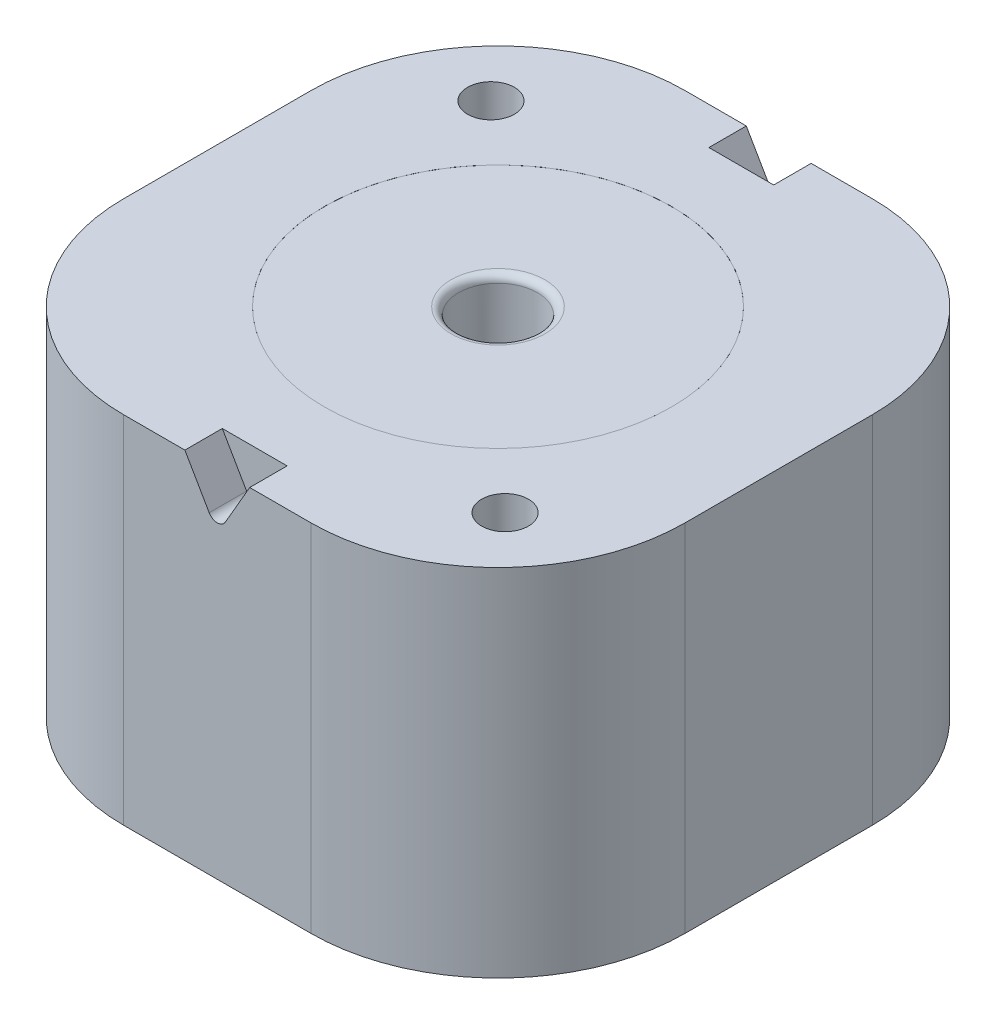
ISO-10303-21;
HEADER;
FILE_DESCRIPTION(('STEP AP214'),'2;1');
FILE_NAME('part.step','',(''),(''),'','','');
FILE_SCHEMA(('AUTOMOTIVE_DESIGN { 1 0 10303 214 1 1 1 1 }'));
ENDSEC;
DATA;
#1=APPLICATION_CONTEXT('core data for automotive mechanical design processes');
#2=APPLICATION_PROTOCOL_DEFINITION('international standard','automotive_design',2000,#1);
#3=PRODUCT_CONTEXT('',#1,'mechanical');
#4=PRODUCT('Part','Part','',(#3));
#5=PRODUCT_RELATED_PRODUCT_CATEGORY('part','',(#4));
#6=PRODUCT_DEFINITION_FORMATION('','',#4);
#7=PRODUCT_DEFINITION_CONTEXT('part definition',#1,'design');
#8=PRODUCT_DEFINITION('design','',#6,#7);
#9=PRODUCT_DEFINITION_SHAPE('','',#8);
#10=(LENGTH_UNIT() NAMED_UNIT(*) SI_UNIT(.MILLI.,.METRE.));
#11=(NAMED_UNIT(*) PLANE_ANGLE_UNIT() SI_UNIT($,.RADIAN.));
#12=(NAMED_UNIT(*) SI_UNIT($,.STERADIAN.) SOLID_ANGLE_UNIT());
#13=UNCERTAINTY_MEASURE_WITH_UNIT(LENGTH_MEASURE(1.E-05),#10,'distance_accuracy_value','');
#14=(GEOMETRIC_REPRESENTATION_CONTEXT(3) GLOBAL_UNCERTAINTY_ASSIGNED_CONTEXT((#13)) GLOBAL_UNIT_ASSIGNED_CONTEXT((#10,
#11,#12)) REPRESENTATION_CONTEXT('',''));
#15=CARTESIAN_POINT('',(0.,0.,0.));
#16=DIRECTION('',(0.,0.,1.));
#17=DIRECTION('',(1.,0.,0.));
#18=AXIS2_PLACEMENT_3D('',#15,#16,#17);
#19=CARTESIAN_POINT('',(-15.,19.,-15.01));
#20=DIRECTION('',(0.,-1.,0.));
#21=DIRECTION('',(0.,0.,-1.));
#22=AXIS2_PLACEMENT_3D('',#19,#20,#21);
#23=PLANE('',#22);
#24=CARTESIAN_POINT('',(9.71815906597584,19.,9.34105517720241));
#25=DIRECTION('',(0.,-1.,0.));
#26=DIRECTION('',(0.,0.,-1.));
#27=AXIS2_PLACEMENT_3D('',#24,#25,#26);
#28=CIRCLE('',#27,1.25);
#29=CARTESIAN_POINT('',(9.71815906597584,19.,8.09105517720241));
#30=VERTEX_POINT('',#29);
#31=EDGE_CURVE('E188',#30,#30,#28,.T.);
#32=ORIENTED_EDGE('',*,*,#31,.T.);
#33=EDGE_LOOP('',(#32));
#34=FACE_BOUND('',#33,.T.);
#35=CARTESIAN_POINT('',(-9.71815906597584,19.,-9.34105517720241));
#36=DIRECTION('',(0.,-1.,0.));
#37=DIRECTION('',(0.,0.,-1.));
#38=AXIS2_PLACEMENT_3D('',#35,#36,#37);
#39=CIRCLE('',#38,1.25);
#40=CARTESIAN_POINT('',(-9.71815906597584,19.,-10.5910551772024));
#41=VERTEX_POINT('',#40);
#42=EDGE_CURVE('E191',#41,#41,#39,.T.);
#43=ORIENTED_EDGE('',*,*,#42,.T.);
#44=EDGE_LOOP('',(#43));
#45=FACE_BOUND('',#44,.T.);
#46=CARTESIAN_POINT('',(0.,19.,0.));
#47=DIRECTION('',(0.,-1.,0.));
#48=DIRECTION('',(0.,0.,-1.));
#49=AXIS2_PLACEMENT_3D('',#46,#47,#48);
#50=CIRCLE('',#49,9.27774999999996);
#51=CARTESIAN_POINT('',(0.,19.,-9.27774999999995));
#52=VERTEX_POINT('',#51);
#53=EDGE_CURVE('E255',#52,#52,#50,.F.);
#54=ORIENTED_EDGE('',*,*,#53,.F.);
#55=EDGE_LOOP('',(#54));
#56=FACE_BOUND('',#55,.T.);
#57=DIRECTION('',(0.,0.,1.));
#58=VECTOR('',#57,1.);
#59=CARTESIAN_POINT('',(-1.73205080756887,19.,-15.01));
#60=LINE('',#59,#58);
#61=CARTESIAN_POINT('',(-1.73205080756888,19.,-15.));
#62=VERTEX_POINT('',#61);
#63=CARTESIAN_POINT('',(-1.73205080756887,19.,-13.));
#64=VERTEX_POINT('',#63);
#65=EDGE_CURVE('E170',#62,#64,#60,.T.);
#66=ORIENTED_EDGE('',*,*,#65,.F.);
#67=DIRECTION('',(1.,0.,0.));
#68=VECTOR('',#67,1.);
#69=CARTESIAN_POINT('',(15.,19.,-15.));
#70=LINE('',#69,#68);
#71=CARTESIAN_POINT('',(-5.,19.,-15.));
#72=VERTEX_POINT('',#71);
#73=EDGE_CURVE('E259',#72,#62,#70,.T.);
#74=ORIENTED_EDGE('',*,*,#73,.F.);
#75=CARTESIAN_POINT('',(-5.,19.,-4.99999999999999));
#76=DIRECTION('',(0.,-1.,0.));
#77=DIRECTION('',(0.,0.,-1.));
#78=AXIS2_PLACEMENT_3D('',#75,#76,#77);
#79=CIRCLE('',#78,10.);
#80=CARTESIAN_POINT('',(-15.,19.,-4.99999999999999));
#81=VERTEX_POINT('',#80);
#82=EDGE_CURVE('E265',#72,#81,#79,.F.);
#83=ORIENTED_EDGE('',*,*,#82,.T.);
#84=DIRECTION('',(0.,0.,-1.));
#85=VECTOR('',#84,1.);
#86=CARTESIAN_POINT('',(-15.,19.,-15.));
#87=LINE('',#86,#85);
#88=CARTESIAN_POINT('',(-15.,19.,5.00000000000001));
#89=VERTEX_POINT('',#88);
#90=EDGE_CURVE('E263',#89,#81,#87,.T.);
#91=ORIENTED_EDGE('',*,*,#90,.F.);
#92=CARTESIAN_POINT('',(-5.,19.,5.00000000000001));
#93=DIRECTION('',(0.,-1.,0.));
#94=DIRECTION('',(0.,0.,-1.));
#95=AXIS2_PLACEMENT_3D('',#92,#93,#94);
#96=CIRCLE('',#95,10.);
#97=CARTESIAN_POINT('',(-5.,19.,15.));
#98=VERTEX_POINT('',#97);
#99=EDGE_CURVE('E270',#89,#98,#96,.F.);
#100=ORIENTED_EDGE('',*,*,#99,.T.);
#101=DIRECTION('',(-1.,0.,0.));
#102=VECTOR('',#101,1.);
#103=CARTESIAN_POINT('',(15.,19.,15.));
#104=LINE('',#103,#102);
#105=CARTESIAN_POINT('',(-1.73205080756887,19.,15.));
#106=VERTEX_POINT('',#105);
#107=EDGE_CURVE('E258',#106,#98,#104,.T.);
#108=ORIENTED_EDGE('',*,*,#107,.F.);
#109=DIRECTION('',(0.,0.,-1.));
#110=VECTOR('',#109,1.);
#111=CARTESIAN_POINT('',(-1.73205080756887,19.,-15.01));
#112=LINE('',#111,#110);
#113=CARTESIAN_POINT('',(-1.73205080756887,19.,13.));
#114=VERTEX_POINT('',#113);
#115=EDGE_CURVE('E185',#106,#114,#112,.T.);
#116=ORIENTED_EDGE('',*,*,#115,.T.);
#117=DIRECTION('',(-1.,0.,0.));
#118=VECTOR('',#117,1.);
#119=CARTESIAN_POINT('',(-15.,19.,13.));
#120=LINE('',#119,#118);
#121=CARTESIAN_POINT('',(1.73205080756888,19.,13.));
#122=VERTEX_POINT('',#121);
#123=EDGE_CURVE('E288',#122,#114,#120,.T.);
#124=ORIENTED_EDGE('',*,*,#123,.F.);
#125=DIRECTION('',(0.,0.,1.));
#126=VECTOR('',#125,1.);
#127=CARTESIAN_POINT('',(1.73205080756888,19.,-15.01));
#128=LINE('',#127,#126);
#129=CARTESIAN_POINT('',(1.73205080756888,19.,15.));
#130=VERTEX_POINT('',#129);
#131=EDGE_CURVE('E181',#122,#130,#128,.T.);
#132=ORIENTED_EDGE('',*,*,#131,.T.);
#133=CARTESIAN_POINT('',(5.,19.,15.));
#134=VERTEX_POINT('',#133);
#135=EDGE_CURVE('E260',#134,#130,#104,.T.);
#136=ORIENTED_EDGE('',*,*,#135,.F.);
#137=CARTESIAN_POINT('',(5.,19.,5.00000000000001));
#138=DIRECTION('',(0.,-1.,0.));
#139=DIRECTION('',(0.,0.,-1.));
#140=AXIS2_PLACEMENT_3D('',#137,#138,#139);
#141=CIRCLE('',#140,10.);
#142=CARTESIAN_POINT('',(15.,19.,5.));
#143=VERTEX_POINT('',#142);
#144=EDGE_CURVE('E266',#134,#143,#141,.F.);
#145=ORIENTED_EDGE('',*,*,#144,.T.);
#146=DIRECTION('',(0.,0.,1.));
#147=VECTOR('',#146,1.);
#148=CARTESIAN_POINT('',(15.,19.,-15.));
#149=LINE('',#148,#147);
#150=CARTESIAN_POINT('',(15.,19.,-4.99999999999999));
#151=VERTEX_POINT('',#150);
#152=EDGE_CURVE('E256',#151,#143,#149,.T.);
#153=ORIENTED_EDGE('',*,*,#152,.F.);
#154=CARTESIAN_POINT('',(5.,19.,-4.99999999999999));
#155=DIRECTION('',(0.,-1.,0.));
#156=DIRECTION('',(0.,0.,-1.));
#157=AXIS2_PLACEMENT_3D('',#154,#155,#156);
#158=CIRCLE('',#157,10.);
#159=CARTESIAN_POINT('',(4.99999999999999,19.,-15.));
#160=VERTEX_POINT('',#159);
#161=EDGE_CURVE('E273',#151,#160,#158,.F.);
#162=ORIENTED_EDGE('',*,*,#161,.T.);
#163=CARTESIAN_POINT('',(1.73205080756888,19.,-15.));
#164=VERTEX_POINT('',#163);
#165=EDGE_CURVE('E169',#164,#160,#70,.T.);
#166=ORIENTED_EDGE('',*,*,#165,.F.);
#167=DIRECTION('',(0.,0.,-1.));
#168=VECTOR('',#167,1.);
#169=CARTESIAN_POINT('',(1.73205080756888,19.,-15.01));
#170=LINE('',#169,#168);
#171=CARTESIAN_POINT('',(1.73205080756888,19.,-13.));
#172=VERTEX_POINT('',#171);
#173=EDGE_CURVE('E150',#172,#164,#170,.T.);
#174=ORIENTED_EDGE('',*,*,#173,.F.);
#175=DIRECTION('',(1.,0.,0.));
#176=VECTOR('',#175,1.);
#177=CARTESIAN_POINT('',(-15.,19.,-13.));
#178=LINE('',#177,#176);
#179=EDGE_CURVE('E160',#64,#172,#178,.T.);
#180=ORIENTED_EDGE('',*,*,#179,.F.);
#181=EDGE_LOOP('',(#66,#74,#83,#91,#100,#108,#116,#124,#132,#136,#145,#153,#162,#166,#174,#180));
#182=FACE_BOUND('',#181,.T.);
#183=ADVANCED_FACE('F33',(#34,#45,#56,#182),#23,.F.);
#184=CARTESIAN_POINT('',(15.,20.,-15.));
#185=DIRECTION('',(0.,0.,1.));
#186=DIRECTION('',(1.,0.,0.));
#187=AXIS2_PLACEMENT_3D('',#184,#185,#186);
#188=PLANE('',#187);
#189=DIRECTION('',(-0.5,0.866025403784438,0.));
#190=VECTOR('',#189,1.);
#191=CARTESIAN_POINT('',(2.01794919243113,12.5048094716167,-15.));
#192=LINE('',#191,#190);
#193=CARTESIAN_POINT('',(-0.433012701892218,16.75,-15.));
#194=VERTEX_POINT('',#193);
#195=EDGE_CURVE('E166',#194,#62,#192,.T.);
#196=ORIENTED_EDGE('',*,*,#195,.F.);
#197=CARTESIAN_POINT('',(0.,17.,-15.));
#198=DIRECTION('',(0.,0.,1.));
#199=DIRECTION('',(1.,0.,0.));
#200=AXIS2_PLACEMENT_3D('',#197,#198,#199);
#201=CIRCLE('',#200,0.5);
#202=CARTESIAN_POINT('',(0.433012701892225,16.75,-15.));
#203=VERTEX_POINT('',#202);
#204=EDGE_CURVE('E41',#194,#203,#201,.T.);
#205=ORIENTED_EDGE('',*,*,#204,.T.);
#206=DIRECTION('',(0.5,0.866025403784439,0.));
#207=VECTOR('',#206,1.);
#208=CARTESIAN_POINT('',(0.,16.,-15.));
#209=LINE('',#208,#207);
#210=EDGE_CURVE('E175',#203,#164,#209,.T.);
#211=ORIENTED_EDGE('',*,*,#210,.T.);
#212=ORIENTED_EDGE('',*,*,#165,.T.);
#213=DIRECTION('',(0.,-1.,0.));
#214=VECTOR('',#213,1.);
#215=CARTESIAN_POINT('',(4.99999999999999,20.,-15.));
#216=LINE('',#215,#214);
#217=CARTESIAN_POINT('',(4.99999999999999,0.,-15.));
#218=VERTEX_POINT('',#217);
#219=EDGE_CURVE('E240',#160,#218,#216,.T.);
#220=ORIENTED_EDGE('',*,*,#219,.T.);
#221=DIRECTION('',(-1.,0.,0.));
#222=VECTOR('',#221,1.);
#223=CARTESIAN_POINT('',(15.,0.,-15.));
#224=LINE('',#223,#222);
#225=CARTESIAN_POINT('',(-5.,0.,-15.));
#226=VERTEX_POINT('',#225);
#227=EDGE_CURVE('E224',#218,#226,#224,.T.);
#228=ORIENTED_EDGE('',*,*,#227,.T.);
#229=DIRECTION('',(0.,-1.,0.));
#230=VECTOR('',#229,1.);
#231=CARTESIAN_POINT('',(-5.,20.,-15.));
#232=LINE('',#231,#230);
#233=EDGE_CURVE('E242',#226,#72,#232,.F.);
#234=ORIENTED_EDGE('',*,*,#233,.T.);
#235=ORIENTED_EDGE('',*,*,#73,.T.);
#236=EDGE_LOOP('',(#196,#205,#211,#212,#220,#228,#234,#235));
#237=FACE_BOUND('',#236,.T.);
#238=ADVANCED_FACE('F303',(#237),#188,.F.);
#239=CARTESIAN_POINT('',(15.,20.,-15.));
#240=DIRECTION('',(-1.,0.,0.));
#241=DIRECTION('',(0.,0.,1.));
#242=AXIS2_PLACEMENT_3D('',#239,#240,#241);
#243=PLANE('',#242);
#244=DIRECTION('',(0.,-1.,0.));
#245=VECTOR('',#244,1.);
#246=CARTESIAN_POINT('',(15.,20.,-4.99999999999999));
#247=LINE('',#246,#245);
#248=CARTESIAN_POINT('',(15.,0.,-4.99999999999999));
#249=VERTEX_POINT('',#248);
#250=EDGE_CURVE('E247',#249,#151,#247,.F.);
#251=ORIENTED_EDGE('',*,*,#250,.T.);
#252=ORIENTED_EDGE('',*,*,#152,.T.);
#253=DIRECTION('',(0.,-1.,0.));
#254=VECTOR('',#253,1.);
#255=CARTESIAN_POINT('',(15.,20.,5.));
#256=LINE('',#255,#254);
#257=CARTESIAN_POINT('',(15.,0.,5.));
#258=VERTEX_POINT('',#257);
#259=EDGE_CURVE('E245',#143,#258,#256,.T.);
#260=ORIENTED_EDGE('',*,*,#259,.T.);
#261=DIRECTION('',(0.,0.,-1.));
#262=VECTOR('',#261,1.);
#263=CARTESIAN_POINT('',(15.,0.,-15.));
#264=LINE('',#263,#262);
#265=EDGE_CURVE('E221',#258,#249,#264,.T.);
#266=ORIENTED_EDGE('',*,*,#265,.T.);
#267=EDGE_LOOP('',(#251,#252,#260,#266));
#268=FACE_BOUND('',#267,.T.);
#269=ADVANCED_FACE('F350',(#268),#243,.F.);
#270=CARTESIAN_POINT('',(0.,0.,0.));
#271=DIRECTION('',(0.,-1.,0.));
#272=DIRECTION('',(0.,0.,-1.));
#273=AXIS2_PLACEMENT_3D('',#270,#271,#272);
#274=PLANE('',#273);
#275=DIRECTION('',(0.,0.,1.));
#276=VECTOR('',#275,1.);
#277=CARTESIAN_POINT('',(-15.,0.,-15.));
#278=LINE('',#277,#276);
#279=CARTESIAN_POINT('',(-15.,0.,-4.99999999999999));
#280=VERTEX_POINT('',#279);
#281=CARTESIAN_POINT('',(-15.,0.,5.00000000000001));
#282=VERTEX_POINT('',#281);
#283=EDGE_CURVE('E215',#280,#282,#278,.T.);
#284=ORIENTED_EDGE('',*,*,#283,.F.);
#285=CARTESIAN_POINT('',(-5.,0.,-4.99999999999999));
#286=DIRECTION('',(0.,-1.,0.));
#287=DIRECTION('',(0.,0.,-1.));
#288=AXIS2_PLACEMENT_3D('',#285,#286,#287);
#289=CIRCLE('',#288,10.);
#290=EDGE_CURVE('E238',#280,#226,#289,.T.);
#291=ORIENTED_EDGE('',*,*,#290,.T.);
#292=ORIENTED_EDGE('',*,*,#227,.F.);
#293=CARTESIAN_POINT('',(5.,0.,-4.99999999999999));
#294=DIRECTION('',(0.,-1.,0.));
#295=DIRECTION('',(0.,0.,-1.));
#296=AXIS2_PLACEMENT_3D('',#293,#294,#295);
#297=CIRCLE('',#296,10.);
#298=EDGE_CURVE('E236',#218,#249,#297,.T.);
#299=ORIENTED_EDGE('',*,*,#298,.T.);
#300=ORIENTED_EDGE('',*,*,#265,.F.);
#301=CARTESIAN_POINT('',(5.,0.,5.00000000000001));
#302=DIRECTION('',(0.,-1.,0.));
#303=DIRECTION('',(0.,0.,-1.));
#304=AXIS2_PLACEMENT_3D('',#301,#302,#303);
#305=CIRCLE('',#304,10.);
#306=CARTESIAN_POINT('',(5.,0.,15.));
#307=VERTEX_POINT('',#306);
#308=EDGE_CURVE('E232',#258,#307,#305,.T.);
#309=ORIENTED_EDGE('',*,*,#308,.T.);
#310=DIRECTION('',(1.,0.,0.));
#311=VECTOR('',#310,1.);
#312=CARTESIAN_POINT('',(15.,0.,15.));
#313=LINE('',#312,#311);
#314=CARTESIAN_POINT('',(-5.,0.,15.));
#315=VERTEX_POINT('',#314);
#316=EDGE_CURVE('E218',#315,#307,#313,.T.);
#317=ORIENTED_EDGE('',*,*,#316,.F.);
#318=CARTESIAN_POINT('',(-5.,0.,5.00000000000001));
#319=DIRECTION('',(0.,-1.,0.));
#320=DIRECTION('',(0.,0.,-1.));
#321=AXIS2_PLACEMENT_3D('',#318,#319,#320);
#322=CIRCLE('',#321,10.);
#323=EDGE_CURVE('E234',#315,#282,#322,.T.);
#324=ORIENTED_EDGE('',*,*,#323,.T.);
#325=EDGE_LOOP('',(#284,#291,#292,#299,#300,#309,#317,#324));
#326=FACE_BOUND('',#325,.T.);
#327=ADVANCED_FACE('F357',(#326),#274,.T.);
#328=CARTESIAN_POINT('',(15.,20.,15.));
#329=DIRECTION('',(0.,0.,-1.));
#330=DIRECTION('',(-1.,0.,0.));
#331=AXIS2_PLACEMENT_3D('',#328,#329,#330);
#332=PLANE('',#331);
#333=DIRECTION('',(0.5,0.866025403784439,0.));
#334=VECTOR('',#333,1.);
#335=CARTESIAN_POINT('',(0.,16.,15.));
#336=LINE('',#335,#334);
#337=CARTESIAN_POINT('',(0.433012701892225,16.75,15.));
#338=VERTEX_POINT('',#337);
#339=EDGE_CURVE('E172',#338,#130,#336,.T.);
#340=ORIENTED_EDGE('',*,*,#339,.F.);
#341=CARTESIAN_POINT('',(0.,17.,15.));
#342=DIRECTION('',(0.,0.,-1.));
#343=DIRECTION('',(-1.,0.,0.));
#344=AXIS2_PLACEMENT_3D('',#341,#342,#343);
#345=CIRCLE('',#344,0.5);
#346=CARTESIAN_POINT('',(-0.433012701892215,16.75,15.));
#347=VERTEX_POINT('',#346);
#348=EDGE_CURVE('E11',#338,#347,#345,.T.);
#349=ORIENTED_EDGE('',*,*,#348,.T.);
#350=DIRECTION('',(-0.5,0.866025403784438,0.));
#351=VECTOR('',#350,1.);
#352=CARTESIAN_POINT('',(2.01794919243113,12.5048094716167,15.));
#353=LINE('',#352,#351);
#354=EDGE_CURVE('E286',#347,#106,#353,.T.);
#355=ORIENTED_EDGE('',*,*,#354,.T.);
#356=ORIENTED_EDGE('',*,*,#107,.T.);
#357=DIRECTION('',(0.,-1.,0.));
#358=VECTOR('',#357,1.);
#359=CARTESIAN_POINT('',(-5.,20.,15.));
#360=LINE('',#359,#358);
#361=EDGE_CURVE('E253',#98,#315,#360,.T.);
#362=ORIENTED_EDGE('',*,*,#361,.T.);
#363=ORIENTED_EDGE('',*,*,#316,.T.);
#364=DIRECTION('',(0.,-1.,0.));
#365=VECTOR('',#364,1.);
#366=CARTESIAN_POINT('',(5.,20.,15.));
#367=LINE('',#366,#365);
#368=EDGE_CURVE('E250',#307,#134,#367,.F.);
#369=ORIENTED_EDGE('',*,*,#368,.T.);
#370=ORIENTED_EDGE('',*,*,#135,.T.);
#371=EDGE_LOOP('',(#340,#349,#355,#356,#362,#363,#369,#370));
#372=FACE_BOUND('',#371,.T.);
#373=ADVANCED_FACE('F328',(#372),#332,.F.);
#374=CARTESIAN_POINT('',(5.,20.,5.00000000000001));
#375=DIRECTION('',(0.,-1.,0.));
#376=DIRECTION('',(0.,0.,-1.));
#377=AXIS2_PLACEMENT_3D('',#374,#375,#376);
#378=CYLINDRICAL_SURFACE('',#377,10.);
#379=ORIENTED_EDGE('',*,*,#144,.F.);
#380=ORIENTED_EDGE('',*,*,#368,.F.);
#381=ORIENTED_EDGE('',*,*,#308,.F.);
#382=ORIENTED_EDGE('',*,*,#259,.F.);
#383=EDGE_LOOP('',(#379,#380,#381,#382));
#384=FACE_BOUND('',#383,.T.);
#385=ADVANCED_FACE('F347',(#384),#378,.T.);
#386=CARTESIAN_POINT('',(-15.,20.,-15.));
#387=DIRECTION('',(1.,0.,0.));
#388=DIRECTION('',(0.,0.,-1.));
#389=AXIS2_PLACEMENT_3D('',#386,#387,#388);
#390=PLANE('',#389);
#391=DIRECTION('',(0.,-1.,0.));
#392=VECTOR('',#391,1.);
#393=CARTESIAN_POINT('',(-15.,20.,5.00000000000001));
#394=LINE('',#393,#392);
#395=EDGE_CURVE('E227',#282,#89,#394,.F.);
#396=ORIENTED_EDGE('',*,*,#395,.T.);
#397=ORIENTED_EDGE('',*,*,#90,.T.);
#398=DIRECTION('',(0.,-1.,0.));
#399=VECTOR('',#398,1.);
#400=CARTESIAN_POINT('',(-15.,20.,-4.99999999999999));
#401=LINE('',#400,#399);
#402=EDGE_CURVE('E230',#81,#280,#401,.T.);
#403=ORIENTED_EDGE('',*,*,#402,.T.);
#404=ORIENTED_EDGE('',*,*,#283,.T.);
#405=EDGE_LOOP('',(#396,#397,#403,#404));
#406=FACE_BOUND('',#405,.T.);
#407=ADVANCED_FACE('F323',(#406),#390,.F.);
#408=CARTESIAN_POINT('',(-5.,20.,5.00000000000001));
#409=DIRECTION('',(0.,-1.,0.));
#410=DIRECTION('',(0.,0.,-1.));
#411=AXIS2_PLACEMENT_3D('',#408,#409,#410);
#412=CYLINDRICAL_SURFACE('',#411,10.);
#413=ORIENTED_EDGE('',*,*,#99,.F.);
#414=ORIENTED_EDGE('',*,*,#395,.F.);
#415=ORIENTED_EDGE('',*,*,#323,.F.);
#416=ORIENTED_EDGE('',*,*,#361,.F.);
#417=EDGE_LOOP('',(#413,#414,#415,#416));
#418=FACE_BOUND('',#417,.T.);
#419=ADVANCED_FACE('F326',(#418),#412,.T.);
#420=CARTESIAN_POINT('',(5.,20.,-4.99999999999999));
#421=DIRECTION('',(0.,-1.,0.));
#422=DIRECTION('',(0.,0.,-1.));
#423=AXIS2_PLACEMENT_3D('',#420,#421,#422);
#424=CYLINDRICAL_SURFACE('',#423,10.);
#425=ORIENTED_EDGE('',*,*,#161,.F.);
#426=ORIENTED_EDGE('',*,*,#250,.F.);
#427=ORIENTED_EDGE('',*,*,#298,.F.);
#428=ORIENTED_EDGE('',*,*,#219,.F.);
#429=EDGE_LOOP('',(#425,#426,#427,#428));
#430=FACE_BOUND('',#429,.T.);
#431=ADVANCED_FACE('F354',(#430),#424,.T.);
#432=CARTESIAN_POINT('',(-5.,20.,-4.99999999999999));
#433=DIRECTION('',(0.,-1.,0.));
#434=DIRECTION('',(0.,0.,-1.));
#435=AXIS2_PLACEMENT_3D('',#432,#433,#434);
#436=CYLINDRICAL_SURFACE('',#435,10.);
#437=ORIENTED_EDGE('',*,*,#82,.F.);
#438=ORIENTED_EDGE('',*,*,#233,.F.);
#439=ORIENTED_EDGE('',*,*,#290,.F.);
#440=ORIENTED_EDGE('',*,*,#402,.F.);
#441=EDGE_LOOP('',(#437,#438,#439,#440));
#442=FACE_BOUND('',#441,.T.);
#443=ADVANCED_FACE('F315',(#442),#436,.T.);
#444=CARTESIAN_POINT('',(0.,320.443462068965,0.));
#445=DIRECTION('',(0.,1.,0.));
#446=DIRECTION('',(0.,0.,1.));
#447=AXIS2_PLACEMENT_3D('',#444,#445,#446);
#448=CYLINDRICAL_SURFACE('',#447,9.27774999999996);
#449=ORIENTED_EDGE('',*,*,#53,.T.);
#450=EDGE_LOOP('',(#449));
#451=FACE_BOUND('',#450,.T.);
#452=CARTESIAN_POINT('',(0.,18.997,0.));
#453=DIRECTION('',(0.,1.,0.));
#454=DIRECTION('',(0.,0.,1.));
#455=AXIS2_PLACEMENT_3D('',#452,#453,#454);
#456=CIRCLE('',#455,9.27774999999996);
#457=CARTESIAN_POINT('',(0.,18.997,9.27774999999997));
#458=VERTEX_POINT('',#457);
#459=EDGE_CURVE('E200',#458,#458,#456,.T.);
#460=ORIENTED_EDGE('',*,*,#459,.F.);
#461=EDGE_LOOP('',(#460));
#462=FACE_BOUND('',#461,.T.);
#463=ADVANCED_FACE('F433',(#451,#462),#448,.F.);
#464=CARTESIAN_POINT('',(-9.27774999999996,18.997,0.));
#465=DIRECTION('',(0.,-1.,0.));
#466=DIRECTION('',(0.,0.,-1.));
#467=AXIS2_PLACEMENT_3D('',#464,#465,#466);
#468=PLANE('',#467);
#469=CARTESIAN_POINT('',(0.,18.997,0.));
#470=DIRECTION('',(0.,-1.,0.));
#471=DIRECTION('',(0.,0.,-1.));
#472=AXIS2_PLACEMENT_3D('',#469,#470,#471);
#473=CIRCLE('',#472,2.50749999999996);
#474=CARTESIAN_POINT('',(0.,18.997,-2.50749999999996));
#475=VERTEX_POINT('',#474);
#476=EDGE_CURVE('E212',#475,#475,#473,.F.);
#477=ORIENTED_EDGE('',*,*,#476,.F.);
#478=EDGE_LOOP('',(#477));
#479=FACE_BOUND('',#478,.T.);
#480=ORIENTED_EDGE('',*,*,#459,.T.);
#481=EDGE_LOOP('',(#480));
#482=FACE_BOUND('',#481,.T.);
#483=ADVANCED_FACE('F429',(#479,#482),#468,.F.);
#484=CARTESIAN_POINT('',(0.,320.443462068965,0.));
#485=DIRECTION('',(0.,1.,0.));
#486=DIRECTION('',(0.,0.,1.));
#487=AXIS2_PLACEMENT_3D('',#484,#485,#486);
#488=CYLINDRICAL_SURFACE('',#487,2.10629999999996);
#489=CARTESIAN_POINT('',(0.,15.3862,0.));
#490=DIRECTION('',(0.,1.,0.));
#491=DIRECTION('',(0.,0.,1.));
#492=AXIS2_PLACEMENT_3D('',#489,#490,#491);
#493=CIRCLE('',#492,2.10629999999996);
#494=CARTESIAN_POINT('',(0.,15.3862,2.10629999999997));
#495=VERTEX_POINT('',#494);
#496=EDGE_CURVE('E206',#495,#495,#493,.T.);
#497=ORIENTED_EDGE('',*,*,#496,.F.);
#498=EDGE_LOOP('',(#497));
#499=FACE_BOUND('',#498,.T.);
#500=CARTESIAN_POINT('',(0.,18.5958,0.));
#501=DIRECTION('',(0.,-1.,0.));
#502=DIRECTION('',(0.,0.,-1.));
#503=AXIS2_PLACEMENT_3D('',#500,#501,#502);
#504=CIRCLE('',#503,2.10629999999996);
#505=CARTESIAN_POINT('',(0.,18.5958,-2.10629999999996));
#506=VERTEX_POINT('',#505);
#507=EDGE_CURVE('E203',#506,#506,#504,.T.);
#508=ORIENTED_EDGE('',*,*,#507,.F.);
#509=EDGE_LOOP('',(#508));
#510=FACE_BOUND('',#509,.T.);
#511=ADVANCED_FACE('F425',(#499,#510),#488,.F.);
#512=CARTESIAN_POINT('',(-2.10629999999996,14.985,0.));
#513=DIRECTION('',(0.,1.,0.));
#514=DIRECTION('',(0.,0.,1.));
#515=AXIS2_PLACEMENT_3D('',#512,#513,#514);
#516=PLANE('',#515);
#517=CARTESIAN_POINT('',(0.,14.985,0.));
#518=DIRECTION('',(0.,1.,0.));
#519=DIRECTION('',(0.,0.,1.));
#520=AXIS2_PLACEMENT_3D('',#517,#518,#519);
#521=CIRCLE('',#520,2.50749999999996);
#522=CARTESIAN_POINT('',(0.,14.985,2.50749999999997));
#523=VERTEX_POINT('',#522);
#524=EDGE_CURVE('E209',#523,#523,#521,.F.);
#525=ORIENTED_EDGE('',*,*,#524,.F.);
#526=EDGE_LOOP('',(#525));
#527=FACE_BOUND('',#526,.T.);
#528=CARTESIAN_POINT('',(0.,14.985,0.));
#529=DIRECTION('',(0.,1.,0.));
#530=DIRECTION('',(0.,0.,1.));
#531=AXIS2_PLACEMENT_3D('',#528,#529,#530);
#532=CIRCLE('',#531,3.00899999999996);
#533=CARTESIAN_POINT('',(0.,14.985,3.00899999999997));
#534=VERTEX_POINT('',#533);
#535=EDGE_CURVE('E197',#534,#534,#532,.T.);
#536=ORIENTED_EDGE('',*,*,#535,.F.);
#537=EDGE_LOOP('',(#536));
#538=FACE_BOUND('',#537,.T.);
#539=ADVANCED_FACE('F421',(#527,#538),#516,.F.);
#540=CARTESIAN_POINT('',(0.,14.985,0.));
#541=DIRECTION('',(0.,1.,0.));
#542=DIRECTION('',(0.,0.,1.));
#543=AXIS2_PLACEMENT_3D('',#540,#541,#542);
#544=CONICAL_SURFACE('',#543,3.00899999999996,0.291456794477867);
#545=CARTESIAN_POINT('',(0.,11.976,0.));
#546=DIRECTION('',(0.,1.,0.));
#547=DIRECTION('',(0.,0.,1.));
#548=AXIS2_PLACEMENT_3D('',#545,#546,#547);
#549=CIRCLE('',#548,2.10629999999996);
#550=CARTESIAN_POINT('',(0.,11.976,2.10629999999997));
#551=VERTEX_POINT('',#550);
#552=EDGE_CURVE('E194',#551,#551,#549,.T.);
#553=ORIENTED_EDGE('',*,*,#552,.F.);
#554=EDGE_LOOP('',(#553));
#555=FACE_BOUND('',#554,.T.);
#556=ORIENTED_EDGE('',*,*,#535,.T.);
#557=EDGE_LOOP('',(#556));
#558=FACE_BOUND('',#557,.T.);
#559=ADVANCED_FACE('F417',(#555,#558),#544,.F.);
#560=CARTESIAN_POINT('',(-2.10629999999996,11.976,0.));
#561=DIRECTION('',(0.,-1.,0.));
#562=DIRECTION('',(0.,0.,-1.));
#563=AXIS2_PLACEMENT_3D('',#560,#561,#562);
#564=PLANE('',#563);
#565=ORIENTED_EDGE('',*,*,#552,.T.);
#566=EDGE_LOOP('',(#565));
#567=FACE_BOUND('',#566,.T.);
#568=ADVANCED_FACE('F413',(#567),#564,.F.);
#569=CARTESIAN_POINT('',(0.,15.3862,0.));
#570=DIRECTION('',(0.,1.,0.));
#571=DIRECTION('',(0.,0.,1.));
#572=AXIS2_PLACEMENT_3D('',#569,#570,#571);
#573=TOROIDAL_SURFACE('',#572,2.50749999999996,0.4012);
#574=ORIENTED_EDGE('',*,*,#524,.T.);
#575=EDGE_LOOP('',(#574));
#576=FACE_BOUND('',#575,.T.);
#577=ORIENTED_EDGE('',*,*,#496,.T.);
#578=EDGE_LOOP('',(#577));
#579=FACE_BOUND('',#578,.T.);
#580=ADVANCED_FACE('F416',(#576,#579),#573,.T.);
#581=CARTESIAN_POINT('',(0.,18.5958,0.));
#582=DIRECTION('',(0.,-1.,0.));
#583=DIRECTION('',(0.,0.,-1.));
#584=AXIS2_PLACEMENT_3D('',#581,#582,#583);
#585=TOROIDAL_SURFACE('',#584,2.50749999999996,0.4012);
#586=ORIENTED_EDGE('',*,*,#507,.T.);
#587=EDGE_LOOP('',(#586));
#588=FACE_BOUND('',#587,.T.);
#589=ORIENTED_EDGE('',*,*,#476,.T.);
#590=EDGE_LOOP('',(#589));
#591=FACE_BOUND('',#590,.T.);
#592=ADVANCED_FACE('F377',(#588,#591),#585,.T.);
#593=CARTESIAN_POINT('',(-9.71815906597584,23.2143564158718,-9.34105517720241));
#594=DIRECTION('',(0.,-1.,0.));
#595=DIRECTION('',(0.,0.,-1.));
#596=AXIS2_PLACEMENT_3D('',#593,#594,#595);
#597=CYLINDRICAL_SURFACE('',#596,1.25);
#598=ORIENTED_EDGE('',*,*,#42,.F.);
#599=EDGE_LOOP('',(#598));
#600=FACE_BOUND('',#599,.T.);
#601=CARTESIAN_POINT('',(-9.71815906597584,5.,-9.34105517720241));
#602=DIRECTION('',(0.,1.,0.));
#603=DIRECTION('',(0.,0.,1.));
#604=AXIS2_PLACEMENT_3D('',#601,#602,#603);
#605=CIRCLE('',#604,1.25);
#606=CARTESIAN_POINT('',(-9.71815906597584,5.,-8.09105517720241));
#607=VERTEX_POINT('',#606);
#608=EDGE_CURVE('E269',#607,#607,#605,.F.);
#609=ORIENTED_EDGE('',*,*,#608,.T.);
#610=EDGE_LOOP('',(#609));
#611=FACE_BOUND('',#610,.T.);
#612=ADVANCED_FACE('F367',(#600,#611),#597,.F.);
#613=CARTESIAN_POINT('',(-9.71815906597584,5.,-9.34105517720241));
#614=DIRECTION('',(0.,1.,0.));
#615=DIRECTION('',(0.,0.,1.));
#616=AXIS2_PLACEMENT_3D('',#613,#614,#615);
#617=PLANE('',#616);
#618=ORIENTED_EDGE('',*,*,#608,.F.);
#619=EDGE_LOOP('',(#618));
#620=FACE_BOUND('',#619,.T.);
#621=ADVANCED_FACE('F403',(#620),#617,.T.);
#622=CARTESIAN_POINT('',(9.71815906597584,23.2143564158718,9.34105517720241));
#623=DIRECTION('',(0.,-1.,0.));
#624=DIRECTION('',(0.,0.,-1.));
#625=AXIS2_PLACEMENT_3D('',#622,#623,#624);
#626=CYLINDRICAL_SURFACE('',#625,1.25);
#627=ORIENTED_EDGE('',*,*,#31,.F.);
#628=EDGE_LOOP('',(#627));
#629=FACE_BOUND('',#628,.T.);
#630=CARTESIAN_POINT('',(9.71815906597584,5.,9.34105517720241));
#631=DIRECTION('',(0.,1.,0.));
#632=DIRECTION('',(0.,0.,1.));
#633=AXIS2_PLACEMENT_3D('',#630,#631,#632);
#634=CIRCLE('',#633,1.25);
#635=CARTESIAN_POINT('',(9.71815906597584,5.,10.5910551772024));
#636=VERTEX_POINT('',#635);
#637=EDGE_CURVE('E283',#636,#636,#634,.F.);
#638=ORIENTED_EDGE('',*,*,#637,.T.);
#639=EDGE_LOOP('',(#638));
#640=FACE_BOUND('',#639,.T.);
#641=ADVANCED_FACE('F400',(#629,#640),#626,.F.);
#642=CARTESIAN_POINT('',(9.71815906597584,5.,9.34105517720241));
#643=DIRECTION('',(0.,1.,0.));
#644=DIRECTION('',(0.,0.,-1.));
#645=AXIS2_PLACEMENT_3D('',#642,#643,#644);
#646=PLANE('',#645);
#647=ORIENTED_EDGE('',*,*,#637,.F.);
#648=EDGE_LOOP('',(#647));
#649=FACE_BOUND('',#648,.T.);
#650=ADVANCED_FACE('F395',(#649),#646,.T.);
#651=CARTESIAN_POINT('',(0.,0.,13.));
#652=DIRECTION('',(0.,0.,1.));
#653=DIRECTION('',(1.,0.,0.));
#654=AXIS2_PLACEMENT_3D('',#651,#652,#653);
#655=PLANE('',#654);
#656=DIRECTION('',(0.5,-0.866025403784438,0.));
#657=VECTOR('',#656,1.);
#658=CARTESIAN_POINT('',(-2.59807621135331,20.5,13.));
#659=LINE('',#658,#657);
#660=CARTESIAN_POINT('',(-0.433012701892215,16.75,13.));
#661=VERTEX_POINT('',#660);
#662=EDGE_CURVE('E177',#114,#661,#659,.T.);
#663=ORIENTED_EDGE('',*,*,#662,.T.);
#664=CARTESIAN_POINT('',(0.,17.,13.));
#665=DIRECTION('',(0.,0.,1.));
#666=DIRECTION('',(1.,0.,0.));
#667=AXIS2_PLACEMENT_3D('',#664,#665,#666);
#668=CIRCLE('',#667,0.5);
#669=CARTESIAN_POINT('',(0.433012701892225,16.75,13.));
#670=VERTEX_POINT('',#669);
#671=EDGE_CURVE('E300',#661,#670,#668,.T.);
#672=ORIENTED_EDGE('',*,*,#671,.T.);
#673=DIRECTION('',(0.5,0.866025403784439,0.));
#674=VECTOR('',#673,1.);
#675=CARTESIAN_POINT('',(0.,16.,13.));
#676=LINE('',#675,#674);
#677=EDGE_CURVE('E179',#670,#122,#676,.T.);
#678=ORIENTED_EDGE('',*,*,#677,.T.);
#679=ORIENTED_EDGE('',*,*,#123,.T.);
#680=EDGE_LOOP('',(#663,#672,#678,#679));
#681=FACE_BOUND('',#680,.T.);
#682=ADVANCED_FACE('F335',(#681),#655,.T.);
#683=CARTESIAN_POINT('',(-2.59807621135331,20.5,13.));
#684=DIRECTION('',(-0.866025403784438,-0.5,0.));
#685=DIRECTION('',(0.5,-0.866025403784438,0.));
#686=AXIS2_PLACEMENT_3D('',#683,#684,#685);
#687=PLANE('',#686);
#688=ORIENTED_EDGE('',*,*,#354,.F.);
#689=DIRECTION('',(0.,0.,1.));
#690=VECTOR('',#689,1.);
#691=CARTESIAN_POINT('',(-0.433012701892215,16.75,13.));
#692=LINE('',#691,#690);
#693=EDGE_CURVE('E48',#347,#661,#692,.F.);
#694=ORIENTED_EDGE('',*,*,#693,.T.);
#695=ORIENTED_EDGE('',*,*,#662,.F.);
#696=ORIENTED_EDGE('',*,*,#115,.F.);
#697=EDGE_LOOP('',(#688,#694,#695,#696));
#698=FACE_BOUND('',#697,.T.);
#699=ADVANCED_FACE('F332',(#698),#687,.F.);
#700=CARTESIAN_POINT('',(0.,16.,13.));
#701=DIRECTION('',(0.866025403784439,-0.5,0.));
#702=DIRECTION('',(0.5,0.866025403784439,0.));
#703=AXIS2_PLACEMENT_3D('',#700,#701,#702);
#704=PLANE('',#703);
#705=ORIENTED_EDGE('',*,*,#677,.F.);
#706=DIRECTION('',(0.,0.,1.));
#707=VECTOR('',#706,1.);
#708=CARTESIAN_POINT('',(0.433012701892225,16.75,15.));
#709=LINE('',#708,#707);
#710=EDGE_CURVE('E296',#670,#338,#709,.T.);
#711=ORIENTED_EDGE('',*,*,#710,.T.);
#712=ORIENTED_EDGE('',*,*,#339,.T.);
#713=ORIENTED_EDGE('',*,*,#131,.F.);
#714=EDGE_LOOP('',(#705,#711,#712,#713));
#715=FACE_BOUND('',#714,.T.);
#716=ADVANCED_FACE('F340',(#715),#704,.F.);
#717=CARTESIAN_POINT('',(0.,0.,-13.));
#718=DIRECTION('',(0.,0.,-1.));
#719=DIRECTION('',(1.,0.,0.));
#720=AXIS2_PLACEMENT_3D('',#717,#718,#719);
#721=PLANE('',#720);
#722=DIRECTION('',(0.5,0.866025403784439,0.));
#723=VECTOR('',#722,1.);
#724=CARTESIAN_POINT('',(0.,16.,-13.));
#725=LINE('',#724,#723);
#726=CARTESIAN_POINT('',(0.433012701892225,16.75,-13.));
#727=VERTEX_POINT('',#726);
#728=EDGE_CURVE('E145',#727,#172,#725,.T.);
#729=ORIENTED_EDGE('',*,*,#728,.F.);
#730=CARTESIAN_POINT('',(0.,17.,-13.));
#731=DIRECTION('',(0.,0.,-1.));
#732=DIRECTION('',(-1.,0.,0.));
#733=AXIS2_PLACEMENT_3D('',#730,#731,#732);
#734=CIRCLE('',#733,0.5);
#735=CARTESIAN_POINT('',(-0.433012701892215,16.75,-13.));
#736=VERTEX_POINT('',#735);
#737=EDGE_CURVE('E294',#727,#736,#734,.T.);
#738=ORIENTED_EDGE('',*,*,#737,.T.);
#739=DIRECTION('',(0.5,-0.866025403784438,0.));
#740=VECTOR('',#739,1.);
#741=CARTESIAN_POINT('',(-2.59807621135331,20.5,-13.));
#742=LINE('',#741,#740);
#743=EDGE_CURVE('E156',#64,#736,#742,.T.);
#744=ORIENTED_EDGE('',*,*,#743,.F.);
#745=ORIENTED_EDGE('',*,*,#179,.T.);
#746=EDGE_LOOP('',(#729,#738,#744,#745));
#747=FACE_BOUND('',#746,.T.);
#748=ADVANCED_FACE('F161',(#747),#721,.T.);
#749=CARTESIAN_POINT('',(-2.59807621135331,20.5,-13.));
#750=DIRECTION('',(0.866025403784438,0.5,0.));
#751=DIRECTION('',(-0.5,0.866025403784438,0.));
#752=AXIS2_PLACEMENT_3D('',#749,#750,#751);
#753=PLANE('',#752);
#754=ORIENTED_EDGE('',*,*,#743,.T.);
#755=DIRECTION('',(0.,0.,-1.));
#756=VECTOR('',#755,1.);
#757=CARTESIAN_POINT('',(-0.433012701892215,16.75,-15.));
#758=LINE('',#757,#756);
#759=EDGE_CURVE('E165',#736,#194,#758,.T.);
#760=ORIENTED_EDGE('',*,*,#759,.T.);
#761=ORIENTED_EDGE('',*,*,#195,.T.);
#762=ORIENTED_EDGE('',*,*,#65,.T.);
#763=EDGE_LOOP('',(#754,#760,#761,#762));
#764=FACE_BOUND('',#763,.T.);
#765=ADVANCED_FACE('F308',(#764),#753,.T.);
#766=CARTESIAN_POINT('',(0.,16.,-13.));
#767=DIRECTION('',(-0.866025403784439,0.5,0.));
#768=DIRECTION('',(-0.5,-0.866025403784439,0.));
#769=AXIS2_PLACEMENT_3D('',#766,#767,#768);
#770=PLANE('',#769);
#771=ORIENTED_EDGE('',*,*,#210,.F.);
#772=DIRECTION('',(0.,0.,-1.));
#773=VECTOR('',#772,1.);
#774=CARTESIAN_POINT('',(0.433012701892225,16.75,-13.));
#775=LINE('',#774,#773);
#776=EDGE_CURVE('E153',#203,#727,#775,.F.);
#777=ORIENTED_EDGE('',*,*,#776,.T.);
#778=ORIENTED_EDGE('',*,*,#728,.T.);
#779=ORIENTED_EDGE('',*,*,#173,.T.);
#780=EDGE_LOOP('',(#771,#777,#778,#779));
#781=FACE_BOUND('',#780,.T.);
#782=ADVANCED_FACE('F148',(#781),#770,.T.);
#783=CARTESIAN_POINT('',(0.,17.,-13.));
#784=DIRECTION('',(0.,0.,1.));
#785=DIRECTION('',(1.,0.,0.));
#786=AXIS2_PLACEMENT_3D('',#783,#784,#785);
#787=CYLINDRICAL_SURFACE('',#786,0.5);
#788=ORIENTED_EDGE('',*,*,#737,.F.);
#789=ORIENTED_EDGE('',*,*,#776,.F.);
#790=ORIENTED_EDGE('',*,*,#204,.F.);
#791=ORIENTED_EDGE('',*,*,#759,.F.);
#792=EDGE_LOOP('',(#788,#789,#790,#791));
#793=FACE_BOUND('',#792,.T.);
#794=ADVANCED_FACE('F306',(#793),#787,.F.);
#795=CARTESIAN_POINT('',(0.,17.,13.));
#796=DIRECTION('',(0.,0.,-1.));
#797=DIRECTION('',(-1.,0.,0.));
#798=AXIS2_PLACEMENT_3D('',#795,#796,#797);
#799=CYLINDRICAL_SURFACE('',#798,0.5);
#800=ORIENTED_EDGE('',*,*,#671,.F.);
#801=ORIENTED_EDGE('',*,*,#693,.F.);
#802=ORIENTED_EDGE('',*,*,#348,.F.);
#803=ORIENTED_EDGE('',*,*,#710,.F.);
#804=EDGE_LOOP('',(#800,#801,#802,#803));
#805=FACE_BOUND('',#804,.T.);
#806=ADVANCED_FACE('F35',(#805),#799,.F.);
#807=CLOSED_SHELL('',(#183,#238,#269,#327,#373,#385,#407,#419,#431,#443,#463,#483,#511,#539,
#559,#568,#580,#592,#612,#621,#641,#650,#682,#699,#716,#748,#765,#782,#794,#806));
#808=MANIFOLD_SOLID_BREP('B2',#807);
#809=ADVANCED_BREP_SHAPE_REPRESENTATION('',(#18,#808),#14);
#810=SHAPE_DEFINITION_REPRESENTATION(#9,#809);
ENDSEC;
END-ISO-10303-21;
